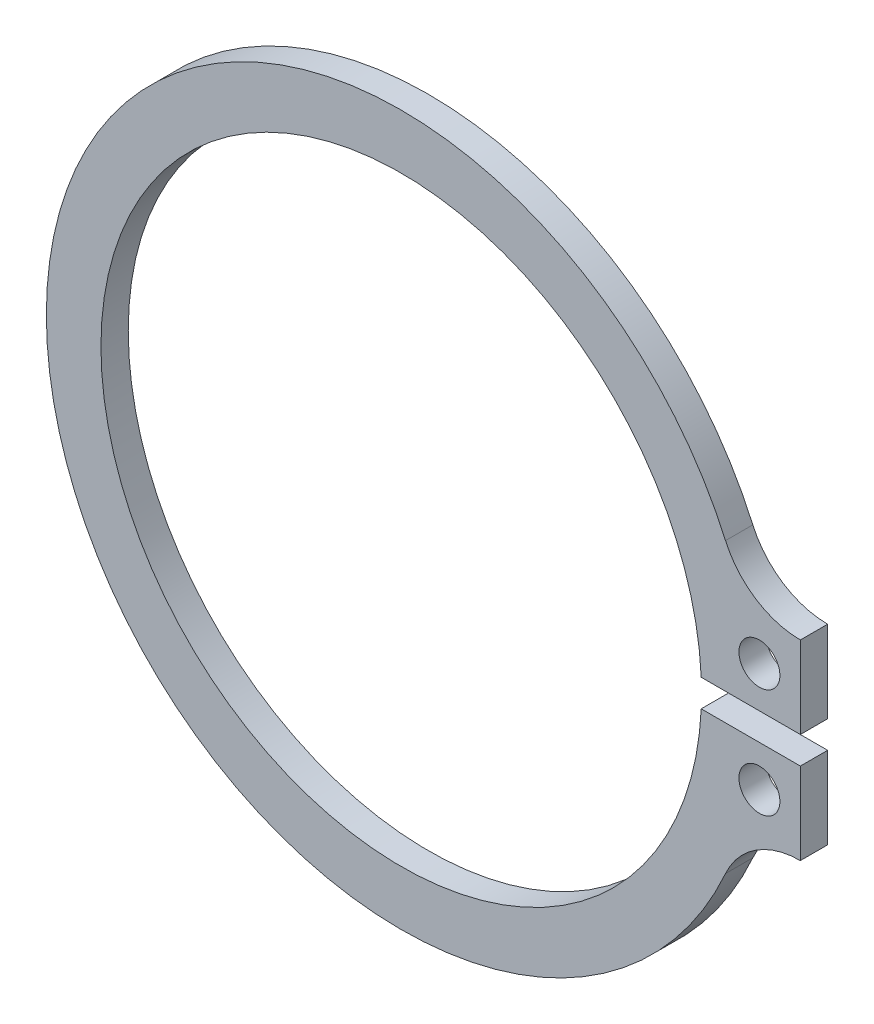
ISO-10303-21;
HEADER;
FILE_DESCRIPTION(('STEP AP214'),'2;1');
FILE_NAME('part.step','',(''),(''),'','','');
FILE_SCHEMA(('AUTOMOTIVE_DESIGN { 1 0 10303 214 1 1 1 1 }'));
ENDSEC;
DATA;
#1=APPLICATION_CONTEXT('core data for automotive mechanical design processes');
#2=APPLICATION_PROTOCOL_DEFINITION('international standard','automotive_design',2000,#1);
#3=PRODUCT_CONTEXT('',#1,'mechanical');
#4=PRODUCT('Part','Part','',(#3));
#5=PRODUCT_RELATED_PRODUCT_CATEGORY('part','',(#4));
#6=PRODUCT_DEFINITION_FORMATION('','',#4);
#7=PRODUCT_DEFINITION_CONTEXT('part definition',#1,'design');
#8=PRODUCT_DEFINITION('design','',#6,#7);
#9=PRODUCT_DEFINITION_SHAPE('','',#8);
#10=(LENGTH_UNIT() NAMED_UNIT(*) SI_UNIT(.MILLI.,.METRE.));
#11=(NAMED_UNIT(*) PLANE_ANGLE_UNIT() SI_UNIT($,.RADIAN.));
#12=(NAMED_UNIT(*) SI_UNIT($,.STERADIAN.) SOLID_ANGLE_UNIT());
#13=UNCERTAINTY_MEASURE_WITH_UNIT(LENGTH_MEASURE(1.E-05),#10,'distance_accuracy_value','');
#14=(GEOMETRIC_REPRESENTATION_CONTEXT(3) GLOBAL_UNCERTAINTY_ASSIGNED_CONTEXT((#13)) GLOBAL_UNIT_ASSIGNED_CONTEXT((#10,
#11,#12)) REPRESENTATION_CONTEXT('',''));
#15=CARTESIAN_POINT('',(0.,0.,0.));
#16=DIRECTION('',(0.,0.,1.));
#17=DIRECTION('',(1.,0.,0.));
#18=AXIS2_PLACEMENT_3D('',#15,#16,#17);
#19=CARTESIAN_POINT('',(14.6201915172135,6.5,41.));
#20=DIRECTION('',(0.,0.,1.));
#21=DIRECTION('',(1.,0.,0.));
#22=AXIS2_PLACEMENT_3D('',#19,#20,#21);
#23=PLANE('',#22);
#24=CARTESIAN_POINT('',(13.1201915172135,2.,41.));
#25=DIRECTION('',(0.,0.,1.));
#26=DIRECTION('',(1.,0.,0.));
#27=AXIS2_PLACEMENT_3D('',#24,#25,#26);
#28=CIRCLE('',#27,0.750000000000002);
#29=CARTESIAN_POINT('',(13.8701915172135,2.,41.));
#30=VERTEX_POINT('',#29);
#31=EDGE_CURVE('E142',#30,#30,#28,.T.);
#32=ORIENTED_EDGE('',*,*,#31,.F.);
#33=EDGE_LOOP('',(#32));
#34=FACE_BOUND('',#33,.T.);
#35=CARTESIAN_POINT('',(14.6201915172135,6.5,41.));
#36=DIRECTION('',(0.,0.,-1.));
#37=DIRECTION('',(1.,0.,0.));
#38=AXIS2_PLACEMENT_3D('',#35,#36,#37);
#39=CIRCLE('',#38,3.);
#40=CARTESIAN_POINT('',(14.6201915172135,3.5,41.));
#41=VERTEX_POINT('',#40);
#42=CARTESIAN_POINT('',(11.8789056077359,5.28125,41.));
#43=VERTEX_POINT('',#42);
#44=EDGE_CURVE('E153',#41,#43,#39,.T.);
#45=ORIENTED_EDGE('',*,*,#44,.T.);
#46=CARTESIAN_POINT('',(0.,0.,41.));
#47=DIRECTION('',(0.,0.,1.));
#48=DIRECTION('',(1.,0.,0.));
#49=AXIS2_PLACEMENT_3D('',#46,#47,#48);
#50=CIRCLE('',#49,13.);
#51=CARTESIAN_POINT('',(11.8789056077359,-5.28125,41.));
#52=VERTEX_POINT('',#51);
#53=EDGE_CURVE('E101',#43,#52,#50,.T.);
#54=ORIENTED_EDGE('',*,*,#53,.T.);
#55=CARTESIAN_POINT('',(14.6201915172135,-6.5,41.));
#56=DIRECTION('',(0.,0.,-1.));
#57=DIRECTION('',(-1.,0.,0.));
#58=AXIS2_PLACEMENT_3D('',#55,#56,#57);
#59=CIRCLE('',#58,3.);
#60=CARTESIAN_POINT('',(14.6201915172135,-3.5,41.));
#61=VERTEX_POINT('',#60);
#62=EDGE_CURVE('E168',#52,#61,#59,.T.);
#63=ORIENTED_EDGE('',*,*,#62,.T.);
#64=DIRECTION('',(0.,1.,0.));
#65=VECTOR('',#64,1.);
#66=CARTESIAN_POINT('',(14.6201915172135,-0.5,41.));
#67=LINE('',#66,#65);
#68=CARTESIAN_POINT('',(14.6201915172135,-0.5,41.));
#69=VERTEX_POINT('',#68);
#70=EDGE_CURVE('E181',#61,#69,#67,.T.);
#71=ORIENTED_EDGE('',*,*,#70,.T.);
#72=DIRECTION('',(-1.,0.,0.));
#73=VECTOR('',#72,1.);
#74=CARTESIAN_POINT('',(10.988630487918,-0.5,41.));
#75=LINE('',#74,#73);
#76=CARTESIAN_POINT('',(10.988630487918,-0.5,41.));
#77=VERTEX_POINT('',#76);
#78=EDGE_CURVE('E120',#69,#77,#75,.T.);
#79=ORIENTED_EDGE('',*,*,#78,.T.);
#80=CARTESIAN_POINT('',(0.,0.,41.));
#81=DIRECTION('',(0.,0.,-1.));
#82=DIRECTION('',(1.,0.,0.));
#83=AXIS2_PLACEMENT_3D('',#80,#81,#82);
#84=CIRCLE('',#83,11.);
#85=CARTESIAN_POINT('',(10.988630487918,0.5,41.));
#86=VERTEX_POINT('',#85);
#87=EDGE_CURVE('E114',#77,#86,#84,.T.);
#88=ORIENTED_EDGE('',*,*,#87,.T.);
#89=DIRECTION('',(1.,0.,0.));
#90=VECTOR('',#89,1.);
#91=CARTESIAN_POINT('',(10.988630487918,0.5,41.));
#92=LINE('',#91,#90);
#93=CARTESIAN_POINT('',(14.6201915172135,0.5,41.));
#94=VERTEX_POINT('',#93);
#95=EDGE_CURVE('E118',#86,#94,#92,.T.);
#96=ORIENTED_EDGE('',*,*,#95,.T.);
#97=DIRECTION('',(0.,1.,0.));
#98=VECTOR('',#97,1.);
#99=CARTESIAN_POINT('',(14.6201915172135,0.5,41.));
#100=LINE('',#99,#98);
#101=EDGE_CURVE('E58',#94,#41,#100,.T.);
#102=ORIENTED_EDGE('',*,*,#101,.T.);
#103=EDGE_LOOP('',(#45,#54,#63,#71,#79,#88,#96,#102));
#104=FACE_BOUND('',#103,.T.);
#105=CARTESIAN_POINT('',(13.1201915172135,-2.,41.));
#106=DIRECTION('',(0.,0.,1.));
#107=DIRECTION('',(-1.,0.,0.));
#108=AXIS2_PLACEMENT_3D('',#105,#106,#107);
#109=CIRCLE('',#108,0.750000000000002);
#110=CARTESIAN_POINT('',(12.3701915172135,-2.,41.));
#111=VERTEX_POINT('',#110);
#112=EDGE_CURVE('E190',#111,#111,#109,.T.);
#113=ORIENTED_EDGE('',*,*,#112,.F.);
#114=EDGE_LOOP('',(#113));
#115=FACE_BOUND('',#114,.T.);
#116=ADVANCED_FACE('F41',(#34,#104,#115),#23,.T.);
#117=CARTESIAN_POINT('',(14.6201915172135,6.5,40.));
#118=DIRECTION('',(0.,0.,1.));
#119=DIRECTION('',(1.,0.,0.));
#120=AXIS2_PLACEMENT_3D('',#117,#118,#119);
#121=PLANE('',#120);
#122=CARTESIAN_POINT('',(14.6201915172135,6.5,40.));
#123=DIRECTION('',(0.,0.,-1.));
#124=DIRECTION('',(1.,0.,0.));
#125=AXIS2_PLACEMENT_3D('',#122,#123,#124);
#126=CIRCLE('',#125,3.);
#127=CARTESIAN_POINT('',(14.6201915172135,3.5,40.));
#128=VERTEX_POINT('',#127);
#129=CARTESIAN_POINT('',(11.8789056077359,5.28125,40.));
#130=VERTEX_POINT('',#129);
#131=EDGE_CURVE('E138',#128,#130,#126,.T.);
#132=ORIENTED_EDGE('',*,*,#131,.F.);
#133=DIRECTION('',(0.,1.,0.));
#134=VECTOR('',#133,1.);
#135=CARTESIAN_POINT('',(14.6201915172135,0.5,40.));
#136=LINE('',#135,#134);
#137=CARTESIAN_POINT('',(14.6201915172135,0.5,40.));
#138=VERTEX_POINT('',#137);
#139=EDGE_CURVE('E93',#138,#128,#136,.T.);
#140=ORIENTED_EDGE('',*,*,#139,.F.);
#141=DIRECTION('',(1.,0.,0.));
#142=VECTOR('',#141,1.);
#143=CARTESIAN_POINT('',(10.988630487918,0.5,40.));
#144=LINE('',#143,#142);
#145=CARTESIAN_POINT('',(10.988630487918,0.5,40.));
#146=VERTEX_POINT('',#145);
#147=EDGE_CURVE('E87',#146,#138,#144,.T.);
#148=ORIENTED_EDGE('',*,*,#147,.F.);
#149=CARTESIAN_POINT('',(0.,0.,40.));
#150=DIRECTION('',(0.,0.,-1.));
#151=DIRECTION('',(1.,0.,0.));
#152=AXIS2_PLACEMENT_3D('',#149,#150,#151);
#153=CIRCLE('',#152,11.);
#154=CARTESIAN_POINT('',(10.988630487918,-0.5,40.));
#155=VERTEX_POINT('',#154);
#156=EDGE_CURVE('E128',#155,#146,#153,.T.);
#157=ORIENTED_EDGE('',*,*,#156,.F.);
#158=DIRECTION('',(-1.,0.,0.));
#159=VECTOR('',#158,1.);
#160=CARTESIAN_POINT('',(10.988630487918,-0.5,40.));
#161=LINE('',#160,#159);
#162=CARTESIAN_POINT('',(14.6201915172135,-0.5,40.));
#163=VERTEX_POINT('',#162);
#164=EDGE_CURVE('E148',#163,#155,#161,.T.);
#165=ORIENTED_EDGE('',*,*,#164,.F.);
#166=DIRECTION('',(0.,1.,0.));
#167=VECTOR('',#166,1.);
#168=CARTESIAN_POINT('',(14.6201915172135,-0.5,40.));
#169=LINE('',#168,#167);
#170=CARTESIAN_POINT('',(14.6201915172135,-3.5,40.));
#171=VERTEX_POINT('',#170);
#172=EDGE_CURVE('E146',#171,#163,#169,.T.);
#173=ORIENTED_EDGE('',*,*,#172,.F.);
#174=CARTESIAN_POINT('',(14.6201915172135,-6.5,40.));
#175=DIRECTION('',(0.,0.,-1.));
#176=DIRECTION('',(-1.,0.,0.));
#177=AXIS2_PLACEMENT_3D('',#174,#175,#176);
#178=CIRCLE('',#177,3.);
#179=CARTESIAN_POINT('',(11.8789056077359,-5.28125,40.));
#180=VERTEX_POINT('',#179);
#181=EDGE_CURVE('E144',#180,#171,#178,.T.);
#182=ORIENTED_EDGE('',*,*,#181,.F.);
#183=CARTESIAN_POINT('',(0.,0.,40.));
#184=DIRECTION('',(0.,0.,1.));
#185=DIRECTION('',(1.,0.,0.));
#186=AXIS2_PLACEMENT_3D('',#183,#184,#185);
#187=CIRCLE('',#186,13.);
#188=EDGE_CURVE('E141',#130,#180,#187,.T.);
#189=ORIENTED_EDGE('',*,*,#188,.F.);
#190=EDGE_LOOP('',(#132,#140,#148,#157,#165,#173,#182,#189));
#191=FACE_BOUND('',#190,.T.);
#192=CARTESIAN_POINT('',(13.1201915172135,2.,40.));
#193=DIRECTION('',(0.,0.,1.));
#194=DIRECTION('',(1.,0.,0.));
#195=AXIS2_PLACEMENT_3D('',#192,#193,#194);
#196=CIRCLE('',#195,0.750000000000002);
#197=CARTESIAN_POINT('',(13.8701915172135,2.,40.));
#198=VERTEX_POINT('',#197);
#199=EDGE_CURVE('E187',#198,#198,#196,.T.);
#200=ORIENTED_EDGE('',*,*,#199,.T.);
#201=EDGE_LOOP('',(#200));
#202=FACE_BOUND('',#201,.T.);
#203=CARTESIAN_POINT('',(13.1201915172135,-2.,40.));
#204=DIRECTION('',(0.,0.,1.));
#205=DIRECTION('',(-1.,0.,0.));
#206=AXIS2_PLACEMENT_3D('',#203,#204,#205);
#207=CIRCLE('',#206,0.750000000000002);
#208=CARTESIAN_POINT('',(12.3701915172135,-2.,40.));
#209=VERTEX_POINT('',#208);
#210=EDGE_CURVE('E193',#209,#209,#207,.T.);
#211=ORIENTED_EDGE('',*,*,#210,.T.);
#212=EDGE_LOOP('',(#211));
#213=FACE_BOUND('',#212,.T.);
#214=ADVANCED_FACE('F172',(#191,#202,#213),#121,.F.);
#215=CARTESIAN_POINT('',(14.6201915172135,6.5,41.));
#216=DIRECTION('',(0.,0.,-1.));
#217=DIRECTION('',(-1.,0.,0.));
#218=AXIS2_PLACEMENT_3D('',#215,#216,#217);
#219=CYLINDRICAL_SURFACE('',#218,3.);
#220=ORIENTED_EDGE('',*,*,#131,.T.);
#221=DIRECTION('',(0.,0.,-1.));
#222=VECTOR('',#221,1.);
#223=CARTESIAN_POINT('',(11.8789056077359,5.28125,41.));
#224=LINE('',#223,#222);
#225=EDGE_CURVE('E11',#43,#130,#224,.T.);
#226=ORIENTED_EDGE('',*,*,#225,.F.);
#227=ORIENTED_EDGE('',*,*,#44,.F.);
#228=DIRECTION('',(0.,0.,-1.));
#229=VECTOR('',#228,1.);
#230=CARTESIAN_POINT('',(14.6201915172135,3.5,41.));
#231=LINE('',#230,#229);
#232=EDGE_CURVE('E134',#41,#128,#231,.T.);
#233=ORIENTED_EDGE('',*,*,#232,.T.);
#234=EDGE_LOOP('',(#220,#226,#227,#233));
#235=FACE_BOUND('',#234,.T.);
#236=ADVANCED_FACE('F43',(#235),#219,.F.);
#237=CARTESIAN_POINT('',(0.,0.,41.));
#238=DIRECTION('',(0.,0.,-1.));
#239=DIRECTION('',(-1.,0.,0.));
#240=AXIS2_PLACEMENT_3D('',#237,#238,#239);
#241=CYLINDRICAL_SURFACE('',#240,13.);
#242=ORIENTED_EDGE('',*,*,#188,.T.);
#243=DIRECTION('',(0.,0.,-1.));
#244=VECTOR('',#243,1.);
#245=CARTESIAN_POINT('',(11.8789056077359,-5.28125,41.));
#246=LINE('',#245,#244);
#247=EDGE_CURVE('E50',#52,#180,#246,.T.);
#248=ORIENTED_EDGE('',*,*,#247,.F.);
#249=ORIENTED_EDGE('',*,*,#53,.F.);
#250=ORIENTED_EDGE('',*,*,#225,.T.);
#251=EDGE_LOOP('',(#242,#248,#249,#250));
#252=FACE_BOUND('',#251,.T.);
#253=ADVANCED_FACE('F226',(#252),#241,.T.);
#254=CARTESIAN_POINT('',(14.6201915172135,-6.5,41.));
#255=DIRECTION('',(0.,0.,-1.));
#256=DIRECTION('',(-1.,0.,0.));
#257=AXIS2_PLACEMENT_3D('',#254,#255,#256);
#258=CYLINDRICAL_SURFACE('',#257,3.);
#259=ORIENTED_EDGE('',*,*,#181,.T.);
#260=DIRECTION('',(0.,0.,-1.));
#261=VECTOR('',#260,1.);
#262=CARTESIAN_POINT('',(14.6201915172135,-3.5,41.));
#263=LINE('',#262,#261);
#264=EDGE_CURVE('E160',#61,#171,#263,.T.);
#265=ORIENTED_EDGE('',*,*,#264,.F.);
#266=ORIENTED_EDGE('',*,*,#62,.F.);
#267=ORIENTED_EDGE('',*,*,#247,.T.);
#268=EDGE_LOOP('',(#259,#265,#266,#267));
#269=FACE_BOUND('',#268,.T.);
#270=ADVANCED_FACE('F166',(#269),#258,.F.);
#271=CARTESIAN_POINT('',(14.6201915172135,-0.5,41.));
#272=DIRECTION('',(-1.,0.,0.));
#273=DIRECTION('',(0.,0.,1.));
#274=AXIS2_PLACEMENT_3D('',#271,#272,#273);
#275=PLANE('',#274);
#276=ORIENTED_EDGE('',*,*,#172,.T.);
#277=DIRECTION('',(0.,0.,-1.));
#278=VECTOR('',#277,1.);
#279=CARTESIAN_POINT('',(14.6201915172135,-0.5,41.));
#280=LINE('',#279,#278);
#281=EDGE_CURVE('E157',#69,#163,#280,.T.);
#282=ORIENTED_EDGE('',*,*,#281,.F.);
#283=ORIENTED_EDGE('',*,*,#70,.F.);
#284=ORIENTED_EDGE('',*,*,#264,.T.);
#285=EDGE_LOOP('',(#276,#282,#283,#284));
#286=FACE_BOUND('',#285,.T.);
#287=ADVANCED_FACE('F177',(#286),#275,.F.);
#288=CARTESIAN_POINT('',(10.988630487918,-0.5,41.));
#289=DIRECTION('',(0.,-1.,0.));
#290=DIRECTION('',(0.,0.,-1.));
#291=AXIS2_PLACEMENT_3D('',#288,#289,#290);
#292=PLANE('',#291);
#293=ORIENTED_EDGE('',*,*,#164,.T.);
#294=DIRECTION('',(0.,0.,-1.));
#295=VECTOR('',#294,1.);
#296=CARTESIAN_POINT('',(10.988630487918,-0.5,41.));
#297=LINE('',#296,#295);
#298=EDGE_CURVE('E129',#77,#155,#297,.T.);
#299=ORIENTED_EDGE('',*,*,#298,.F.);
#300=ORIENTED_EDGE('',*,*,#78,.F.);
#301=ORIENTED_EDGE('',*,*,#281,.T.);
#302=EDGE_LOOP('',(#293,#299,#300,#301));
#303=FACE_BOUND('',#302,.T.);
#304=ADVANCED_FACE('F180',(#303),#292,.F.);
#305=CARTESIAN_POINT('',(0.,0.,41.));
#306=DIRECTION('',(0.,0.,-1.));
#307=DIRECTION('',(-1.,0.,0.));
#308=AXIS2_PLACEMENT_3D('',#305,#306,#307);
#309=CYLINDRICAL_SURFACE('',#308,11.);
#310=ORIENTED_EDGE('',*,*,#156,.T.);
#311=DIRECTION('',(0.,0.,-1.));
#312=VECTOR('',#311,1.);
#313=CARTESIAN_POINT('',(10.988630487918,0.5,41.));
#314=LINE('',#313,#312);
#315=EDGE_CURVE('E125',#86,#146,#314,.T.);
#316=ORIENTED_EDGE('',*,*,#315,.F.);
#317=ORIENTED_EDGE('',*,*,#87,.F.);
#318=ORIENTED_EDGE('',*,*,#298,.T.);
#319=EDGE_LOOP('',(#310,#316,#317,#318));
#320=FACE_BOUND('',#319,.T.);
#321=ADVANCED_FACE('F126',(#320),#309,.F.);
#322=CARTESIAN_POINT('',(10.988630487918,0.5,41.));
#323=DIRECTION('',(0.,1.,0.));
#324=DIRECTION('',(0.,0.,1.));
#325=AXIS2_PLACEMENT_3D('',#322,#323,#324);
#326=PLANE('',#325);
#327=ORIENTED_EDGE('',*,*,#147,.T.);
#328=DIRECTION('',(0.,0.,-1.));
#329=VECTOR('',#328,1.);
#330=CARTESIAN_POINT('',(14.6201915172135,0.5,41.));
#331=LINE('',#330,#329);
#332=EDGE_CURVE('E130',#94,#138,#331,.T.);
#333=ORIENTED_EDGE('',*,*,#332,.F.);
#334=ORIENTED_EDGE('',*,*,#95,.F.);
#335=ORIENTED_EDGE('',*,*,#315,.T.);
#336=EDGE_LOOP('',(#327,#333,#334,#335));
#337=FACE_BOUND('',#336,.T.);
#338=ADVANCED_FACE('F132',(#337),#326,.F.);
#339=CARTESIAN_POINT('',(14.6201915172135,0.5,41.));
#340=DIRECTION('',(-1.,0.,0.));
#341=DIRECTION('',(0.,0.,1.));
#342=AXIS2_PLACEMENT_3D('',#339,#340,#341);
#343=PLANE('',#342);
#344=ORIENTED_EDGE('',*,*,#139,.T.);
#345=ORIENTED_EDGE('',*,*,#232,.F.);
#346=ORIENTED_EDGE('',*,*,#101,.F.);
#347=ORIENTED_EDGE('',*,*,#332,.T.);
#348=EDGE_LOOP('',(#344,#345,#346,#347));
#349=FACE_BOUND('',#348,.T.);
#350=ADVANCED_FACE('F214',(#349),#343,.F.);
#351=CARTESIAN_POINT('',(13.1201915172135,2.,41.));
#352=DIRECTION('',(0.,0.,-1.));
#353=DIRECTION('',(-1.,0.,0.));
#354=AXIS2_PLACEMENT_3D('',#351,#352,#353);
#355=CYLINDRICAL_SURFACE('',#354,0.750000000000002);
#356=ORIENTED_EDGE('',*,*,#31,.T.);
#357=EDGE_LOOP('',(#356));
#358=FACE_BOUND('',#357,.T.);
#359=ORIENTED_EDGE('',*,*,#199,.F.);
#360=EDGE_LOOP('',(#359));
#361=FACE_BOUND('',#360,.T.);
#362=ADVANCED_FACE('F211',(#358,#361),#355,.F.);
#363=CARTESIAN_POINT('',(13.1201915172135,-2.,41.));
#364=DIRECTION('',(0.,0.,-1.));
#365=DIRECTION('',(-1.,0.,0.));
#366=AXIS2_PLACEMENT_3D('',#363,#364,#365);
#367=CYLINDRICAL_SURFACE('',#366,0.750000000000002);
#368=ORIENTED_EDGE('',*,*,#112,.T.);
#369=EDGE_LOOP('',(#368));
#370=FACE_BOUND('',#369,.T.);
#371=ORIENTED_EDGE('',*,*,#210,.F.);
#372=EDGE_LOOP('',(#371));
#373=FACE_BOUND('',#372,.T.);
#374=ADVANCED_FACE('F199',(#370,#373),#367,.F.);
#375=CLOSED_SHELL('',(#116,#214,#236,#253,#270,#287,#304,#321,#338,#350,#362,#374));
#376=MANIFOLD_SOLID_BREP('B2',#375);
#377=ADVANCED_BREP_SHAPE_REPRESENTATION('',(#18,#376),#14);
#378=SHAPE_DEFINITION_REPRESENTATION(#9,#377);
ENDSEC;
END-ISO-10303-21;
